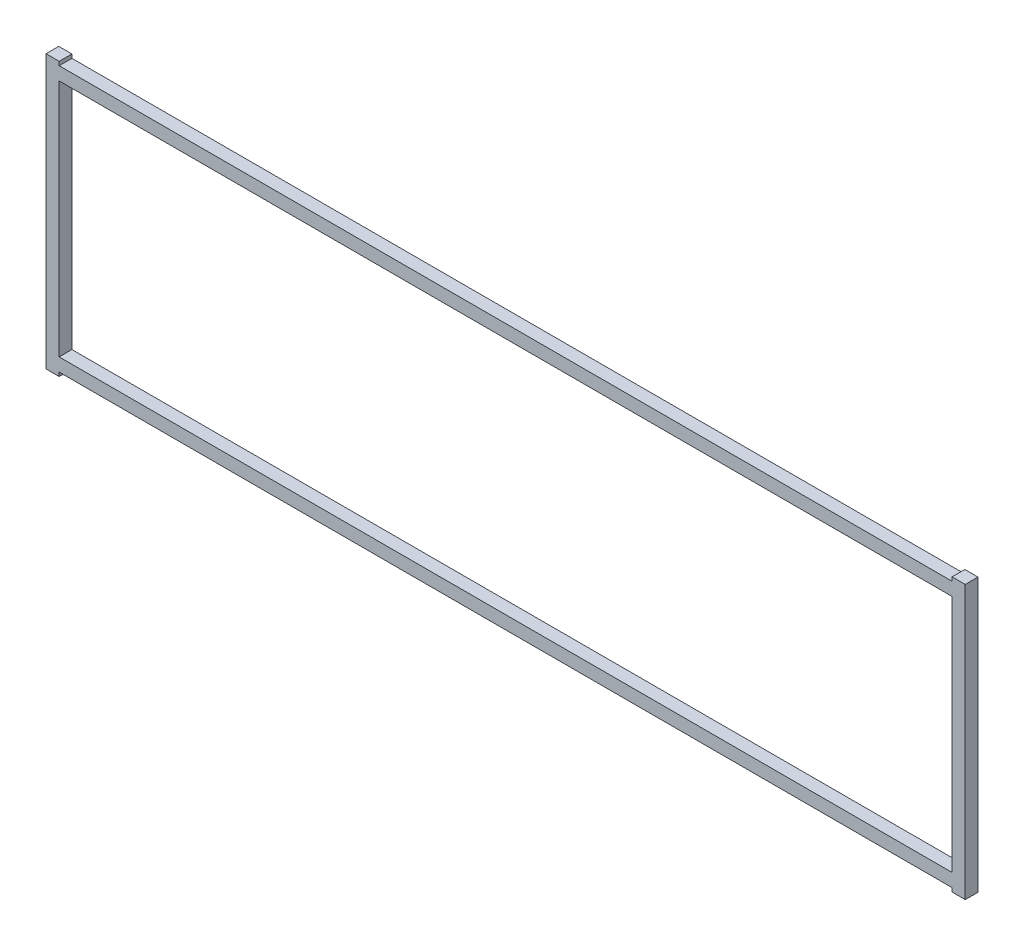
ISO-10303-21;
HEADER;
FILE_DESCRIPTION(('STEP AP214'),'2;1');
FILE_NAME('part.step','',(''),(''),'','','');
FILE_SCHEMA(('AUTOMOTIVE_DESIGN { 1 0 10303 214 1 1 1 1 }'));
ENDSEC;
DATA;
#1=APPLICATION_CONTEXT('core data for automotive mechanical design processes');
#2=APPLICATION_PROTOCOL_DEFINITION('international standard','automotive_design',2000,#1);
#3=PRODUCT_CONTEXT('',#1,'mechanical');
#4=PRODUCT('Part','Part','',(#3));
#5=PRODUCT_RELATED_PRODUCT_CATEGORY('part','',(#4));
#6=PRODUCT_DEFINITION_FORMATION('','',#4);
#7=PRODUCT_DEFINITION_CONTEXT('part definition',#1,'design');
#8=PRODUCT_DEFINITION('design','',#6,#7);
#9=PRODUCT_DEFINITION_SHAPE('','',#8);
#10=(LENGTH_UNIT() NAMED_UNIT(*) SI_UNIT(.MILLI.,.METRE.));
#11=(NAMED_UNIT(*) PLANE_ANGLE_UNIT() SI_UNIT($,.RADIAN.));
#12=(NAMED_UNIT(*) SI_UNIT($,.STERADIAN.) SOLID_ANGLE_UNIT());
#13=UNCERTAINTY_MEASURE_WITH_UNIT(LENGTH_MEASURE(1.E-05),#10,'distance_accuracy_value','');
#14=(GEOMETRIC_REPRESENTATION_CONTEXT(3) GLOBAL_UNCERTAINTY_ASSIGNED_CONTEXT((#13)) GLOBAL_UNIT_ASSIGNED_CONTEXT((#10,
#11,#12)) REPRESENTATION_CONTEXT('',''));
#15=CARTESIAN_POINT('',(0.,0.,0.));
#16=DIRECTION('',(0.,0.,1.));
#17=DIRECTION('',(1.,0.,0.));
#18=AXIS2_PLACEMENT_3D('',#15,#16,#17);
#19=CARTESIAN_POINT('',(0.,0.,6.35));
#20=DIRECTION('',(0.,0.,1.));
#21=DIRECTION('',(1.,0.,0.));
#22=AXIS2_PLACEMENT_3D('',#19,#20,#21);
#23=PLANE('',#22);
#24=DIRECTION('',(0.,-1.,0.));
#25=VECTOR('',#24,1.);
#26=CARTESIAN_POINT('',(222.1484,-66.0146,6.35));
#27=LINE('',#26,#25);
#28=CARTESIAN_POINT('',(222.1484,-66.0146,6.35));
#29=VERTEX_POINT('',#28);
#30=CARTESIAN_POINT('',(222.1484,-67.922775,6.35));
#31=VERTEX_POINT('',#30);
#32=EDGE_CURVE('E201',#29,#31,#27,.T.);
#33=ORIENTED_EDGE('',*,*,#32,.T.);
#34=DIRECTION('',(1.,0.,0.));
#35=VECTOR('',#34,1.);
#36=CARTESIAN_POINT('',(222.1484,-67.922775,6.35));
#37=LINE('',#36,#35);
#38=CARTESIAN_POINT('',(228.7016,-67.922775,6.35));
#39=VERTEX_POINT('',#38);
#40=EDGE_CURVE('E205',#31,#39,#37,.T.);
#41=ORIENTED_EDGE('',*,*,#40,.T.);
#42=DIRECTION('',(0.,1.,0.));
#43=VECTOR('',#42,1.);
#44=CARTESIAN_POINT('',(228.7016,-67.922775,6.35));
#45=LINE('',#44,#43);
#46=CARTESIAN_POINT('',(228.7016,67.922775,6.35));
#47=VERTEX_POINT('',#46);
#48=EDGE_CURVE('E209',#39,#47,#45,.T.);
#49=ORIENTED_EDGE('',*,*,#48,.T.);
#50=DIRECTION('',(-1.,0.,0.));
#51=VECTOR('',#50,1.);
#52=CARTESIAN_POINT('',(228.7016,67.922775,6.35));
#53=LINE('',#52,#51);
#54=CARTESIAN_POINT('',(222.1484,67.922775,6.35));
#55=VERTEX_POINT('',#54);
#56=EDGE_CURVE('E212',#47,#55,#53,.T.);
#57=ORIENTED_EDGE('',*,*,#56,.T.);
#58=DIRECTION('',(0.,-1.,0.));
#59=VECTOR('',#58,1.);
#60=CARTESIAN_POINT('',(222.1484,67.922775,6.35));
#61=LINE('',#60,#59);
#62=CARTESIAN_POINT('',(222.1484,66.0146,6.35));
#63=VERTEX_POINT('',#62);
#64=EDGE_CURVE('E215',#55,#63,#61,.T.);
#65=ORIENTED_EDGE('',*,*,#64,.T.);
#66=DIRECTION('',(-1.,0.,0.));
#67=VECTOR('',#66,1.);
#68=CARTESIAN_POINT('',(222.1484,66.0146,6.35));
#69=LINE('',#68,#67);
#70=CARTESIAN_POINT('',(-222.1484,66.0146,6.35));
#71=VERTEX_POINT('',#70);
#72=EDGE_CURVE('E218',#63,#71,#69,.T.);
#73=ORIENTED_EDGE('',*,*,#72,.T.);
#74=DIRECTION('',(0.,1.,0.));
#75=VECTOR('',#74,1.);
#76=CARTESIAN_POINT('',(-222.1484,66.0146,6.35));
#77=LINE('',#76,#75);
#78=CARTESIAN_POINT('',(-222.1484,67.922775,6.35));
#79=VERTEX_POINT('',#78);
#80=EDGE_CURVE('E221',#71,#79,#77,.T.);
#81=ORIENTED_EDGE('',*,*,#80,.T.);
#82=DIRECTION('',(-1.,0.,0.));
#83=VECTOR('',#82,1.);
#84=CARTESIAN_POINT('',(-222.1484,67.922775,6.35));
#85=LINE('',#84,#83);
#86=CARTESIAN_POINT('',(-228.7016,67.922775,6.35));
#87=VERTEX_POINT('',#86);
#88=EDGE_CURVE('E224',#79,#87,#85,.T.);
#89=ORIENTED_EDGE('',*,*,#88,.T.);
#90=DIRECTION('',(0.,-1.,0.));
#91=VECTOR('',#90,1.);
#92=CARTESIAN_POINT('',(-228.7016,67.922775,6.35));
#93=LINE('',#92,#91);
#94=CARTESIAN_POINT('',(-228.7016,-67.922775,6.35));
#95=VERTEX_POINT('',#94);
#96=EDGE_CURVE('E227',#87,#95,#93,.T.);
#97=ORIENTED_EDGE('',*,*,#96,.T.);
#98=DIRECTION('',(1.,0.,0.));
#99=VECTOR('',#98,1.);
#100=CARTESIAN_POINT('',(-228.7016,-67.922775,6.35));
#101=LINE('',#100,#99);
#102=CARTESIAN_POINT('',(-222.1484,-67.922775,6.35));
#103=VERTEX_POINT('',#102);
#104=EDGE_CURVE('E230',#95,#103,#101,.T.);
#105=ORIENTED_EDGE('',*,*,#104,.T.);
#106=DIRECTION('',(0.,1.,0.));
#107=VECTOR('',#106,1.);
#108=CARTESIAN_POINT('',(-222.1484,-67.922775,6.35));
#109=LINE('',#108,#107);
#110=CARTESIAN_POINT('',(-222.1484,-66.0146,6.35));
#111=VERTEX_POINT('',#110);
#112=EDGE_CURVE('E233',#103,#111,#109,.T.);
#113=ORIENTED_EDGE('',*,*,#112,.T.);
#114=DIRECTION('',(1.,0.,0.));
#115=VECTOR('',#114,1.);
#116=CARTESIAN_POINT('',(-222.1484,-66.0146,6.35));
#117=LINE('',#116,#115);
#118=EDGE_CURVE('E236',#111,#29,#117,.T.);
#119=ORIENTED_EDGE('',*,*,#118,.T.);
#120=EDGE_LOOP('',(#33,#41,#49,#57,#65,#73,#81,#89,#97,#105,#113,#119));
#121=FACE_BOUND('',#120,.T.);
#122=DIRECTION('',(0.,1.,0.));
#123=VECTOR('',#122,1.);
#124=CARTESIAN_POINT('',(222.1484,-59.4614,6.35));
#125=LINE('',#124,#123);
#126=CARTESIAN_POINT('',(222.1484,-59.4614,6.35));
#127=VERTEX_POINT('',#126);
#128=CARTESIAN_POINT('',(222.1484,59.4614,6.35));
#129=VERTEX_POINT('',#128);
#130=EDGE_CURVE('E162',#127,#129,#125,.T.);
#131=ORIENTED_EDGE('',*,*,#130,.F.);
#132=DIRECTION('',(1.,0.,0.));
#133=VECTOR('',#132,1.);
#134=CARTESIAN_POINT('',(-222.1484,-59.4614,6.35));
#135=LINE('',#134,#133);
#136=CARTESIAN_POINT('',(-222.1484,-59.4614,6.35));
#137=VERTEX_POINT('',#136);
#138=EDGE_CURVE('E153',#137,#127,#135,.T.);
#139=ORIENTED_EDGE('',*,*,#138,.F.);
#140=DIRECTION('',(0.,-1.,0.));
#141=VECTOR('',#140,1.);
#142=CARTESIAN_POINT('',(-222.1484,59.4614,6.35));
#143=LINE('',#142,#141);
#144=CARTESIAN_POINT('',(-222.1484,59.4614,6.35));
#145=VERTEX_POINT('',#144);
#146=EDGE_CURVE('E179',#145,#137,#143,.T.);
#147=ORIENTED_EDGE('',*,*,#146,.F.);
#148=DIRECTION('',(-1.,0.,0.));
#149=VECTOR('',#148,1.);
#150=CARTESIAN_POINT('',(222.1484,59.4614,6.35));
#151=LINE('',#150,#149);
#152=EDGE_CURVE('E175',#129,#145,#151,.T.);
#153=ORIENTED_EDGE('',*,*,#152,.F.);
#154=EDGE_LOOP('',(#131,#139,#147,#153));
#155=FACE_BOUND('',#154,.T.);
#156=ADVANCED_FACE('F39',(#121,#155),#23,.T.);
#157=CARTESIAN_POINT('',(0.,0.,0.));
#158=DIRECTION('',(0.,0.,1.));
#159=DIRECTION('',(1.,0.,0.));
#160=AXIS2_PLACEMENT_3D('',#157,#158,#159);
#161=PLANE('',#160);
#162=DIRECTION('',(0.,-1.,0.));
#163=VECTOR('',#162,1.);
#164=CARTESIAN_POINT('',(222.1484,-66.0146,0.));
#165=LINE('',#164,#163);
#166=CARTESIAN_POINT('',(222.1484,-66.0146,0.));
#167=VERTEX_POINT('',#166);
#168=CARTESIAN_POINT('',(222.1484,-67.922775,0.));
#169=VERTEX_POINT('',#168);
#170=EDGE_CURVE('E171',#167,#169,#165,.T.);
#171=ORIENTED_EDGE('',*,*,#170,.F.);
#172=DIRECTION('',(1.,0.,0.));
#173=VECTOR('',#172,1.);
#174=CARTESIAN_POINT('',(-222.1484,-66.0146,0.));
#175=LINE('',#174,#173);
#176=CARTESIAN_POINT('',(-222.1484,-66.0146,0.));
#177=VERTEX_POINT('',#176);
#178=EDGE_CURVE('E206',#177,#167,#175,.T.);
#179=ORIENTED_EDGE('',*,*,#178,.F.);
#180=DIRECTION('',(0.,1.,0.));
#181=VECTOR('',#180,1.);
#182=CARTESIAN_POINT('',(-222.1484,-67.922775,0.));
#183=LINE('',#182,#181);
#184=CARTESIAN_POINT('',(-222.1484,-67.922775,0.));
#185=VERTEX_POINT('',#184);
#186=EDGE_CURVE('E270',#185,#177,#183,.T.);
#187=ORIENTED_EDGE('',*,*,#186,.F.);
#188=DIRECTION('',(1.,0.,0.));
#189=VECTOR('',#188,1.);
#190=CARTESIAN_POINT('',(-228.7016,-67.922775,0.));
#191=LINE('',#190,#189);
#192=CARTESIAN_POINT('',(-228.7016,-67.922775,0.));
#193=VERTEX_POINT('',#192);
#194=EDGE_CURVE('E267',#193,#185,#191,.T.);
#195=ORIENTED_EDGE('',*,*,#194,.F.);
#196=DIRECTION('',(0.,-1.,0.));
#197=VECTOR('',#196,1.);
#198=CARTESIAN_POINT('',(-228.7016,67.922775,0.));
#199=LINE('',#198,#197);
#200=CARTESIAN_POINT('',(-228.7016,67.922775,0.));
#201=VERTEX_POINT('',#200);
#202=EDGE_CURVE('E264',#201,#193,#199,.T.);
#203=ORIENTED_EDGE('',*,*,#202,.F.);
#204=DIRECTION('',(-1.,0.,0.));
#205=VECTOR('',#204,1.);
#206=CARTESIAN_POINT('',(-222.1484,67.922775,0.));
#207=LINE('',#206,#205);
#208=CARTESIAN_POINT('',(-222.1484,67.922775,0.));
#209=VERTEX_POINT('',#208);
#210=EDGE_CURVE('E261',#209,#201,#207,.T.);
#211=ORIENTED_EDGE('',*,*,#210,.F.);
#212=DIRECTION('',(0.,1.,0.));
#213=VECTOR('',#212,1.);
#214=CARTESIAN_POINT('',(-222.1484,66.0146,0.));
#215=LINE('',#214,#213);
#216=CARTESIAN_POINT('',(-222.1484,66.0146,0.));
#217=VERTEX_POINT('',#216);
#218=EDGE_CURVE('E258',#217,#209,#215,.T.);
#219=ORIENTED_EDGE('',*,*,#218,.F.);
#220=DIRECTION('',(-1.,0.,0.));
#221=VECTOR('',#220,1.);
#222=CARTESIAN_POINT('',(222.1484,66.0146,0.));
#223=LINE('',#222,#221);
#224=CARTESIAN_POINT('',(222.1484,66.0146,0.));
#225=VERTEX_POINT('',#224);
#226=EDGE_CURVE('E255',#225,#217,#223,.T.);
#227=ORIENTED_EDGE('',*,*,#226,.F.);
#228=DIRECTION('',(0.,-1.,0.));
#229=VECTOR('',#228,1.);
#230=CARTESIAN_POINT('',(222.1484,67.922775,0.));
#231=LINE('',#230,#229);
#232=CARTESIAN_POINT('',(222.1484,67.922775,0.));
#233=VERTEX_POINT('',#232);
#234=EDGE_CURVE('E252',#233,#225,#231,.T.);
#235=ORIENTED_EDGE('',*,*,#234,.F.);
#236=DIRECTION('',(-1.,0.,0.));
#237=VECTOR('',#236,1.);
#238=CARTESIAN_POINT('',(228.7016,67.922775,0.));
#239=LINE('',#238,#237);
#240=CARTESIAN_POINT('',(228.7016,67.922775,0.));
#241=VERTEX_POINT('',#240);
#242=EDGE_CURVE('E249',#241,#233,#239,.T.);
#243=ORIENTED_EDGE('',*,*,#242,.F.);
#244=DIRECTION('',(0.,1.,0.));
#245=VECTOR('',#244,1.);
#246=CARTESIAN_POINT('',(228.7016,-67.922775,0.));
#247=LINE('',#246,#245);
#248=CARTESIAN_POINT('',(228.7016,-67.922775,0.));
#249=VERTEX_POINT('',#248);
#250=EDGE_CURVE('E246',#249,#241,#247,.T.);
#251=ORIENTED_EDGE('',*,*,#250,.F.);
#252=DIRECTION('',(1.,0.,0.));
#253=VECTOR('',#252,1.);
#254=CARTESIAN_POINT('',(222.1484,-67.922775,0.));
#255=LINE('',#254,#253);
#256=EDGE_CURVE('E243',#169,#249,#255,.T.);
#257=ORIENTED_EDGE('',*,*,#256,.F.);
#258=EDGE_LOOP('',(#171,#179,#187,#195,#203,#211,#219,#227,#235,#243,#251,#257));
#259=FACE_BOUND('',#258,.T.);
#260=DIRECTION('',(1.,0.,0.));
#261=VECTOR('',#260,1.);
#262=CARTESIAN_POINT('',(-222.1484,-59.4614,0.));
#263=LINE('',#262,#261);
#264=CARTESIAN_POINT('',(-222.1484,-59.4614,0.));
#265=VERTEX_POINT('',#264);
#266=CARTESIAN_POINT('',(222.1484,-59.4614,0.));
#267=VERTEX_POINT('',#266);
#268=EDGE_CURVE('E63',#265,#267,#263,.T.);
#269=ORIENTED_EDGE('',*,*,#268,.T.);
#270=DIRECTION('',(0.,1.,0.));
#271=VECTOR('',#270,1.);
#272=CARTESIAN_POINT('',(222.1484,-59.4614,0.));
#273=LINE('',#272,#271);
#274=CARTESIAN_POINT('',(222.1484,59.4614,0.));
#275=VERTEX_POINT('',#274);
#276=EDGE_CURVE('E169',#267,#275,#273,.T.);
#277=ORIENTED_EDGE('',*,*,#276,.T.);
#278=DIRECTION('',(-1.,0.,0.));
#279=VECTOR('',#278,1.);
#280=CARTESIAN_POINT('',(222.1484,59.4614,0.));
#281=LINE('',#280,#279);
#282=CARTESIAN_POINT('',(-222.1484,59.4614,0.));
#283=VERTEX_POINT('',#282);
#284=EDGE_CURVE('E188',#275,#283,#281,.T.);
#285=ORIENTED_EDGE('',*,*,#284,.T.);
#286=DIRECTION('',(0.,-1.,0.));
#287=VECTOR('',#286,1.);
#288=CARTESIAN_POINT('',(-222.1484,59.4614,0.));
#289=LINE('',#288,#287);
#290=EDGE_CURVE('E163',#283,#265,#289,.T.);
#291=ORIENTED_EDGE('',*,*,#290,.T.);
#292=EDGE_LOOP('',(#269,#277,#285,#291));
#293=FACE_BOUND('',#292,.T.);
#294=ADVANCED_FACE('F325',(#259,#293),#161,.F.);
#295=CARTESIAN_POINT('',(222.1484,-66.0146,6.35));
#296=DIRECTION('',(1.,0.,0.));
#297=DIRECTION('',(0.,0.,-1.));
#298=AXIS2_PLACEMENT_3D('',#295,#296,#297);
#299=PLANE('',#298);
#300=ORIENTED_EDGE('',*,*,#170,.T.);
#301=DIRECTION('',(0.,0.,-1.));
#302=VECTOR('',#301,1.);
#303=CARTESIAN_POINT('',(222.1484,-67.922775,6.35));
#304=LINE('',#303,#302);
#305=EDGE_CURVE('E11',#31,#169,#304,.T.);
#306=ORIENTED_EDGE('',*,*,#305,.F.);
#307=ORIENTED_EDGE('',*,*,#32,.F.);
#308=DIRECTION('',(0.,0.,-1.));
#309=VECTOR('',#308,1.);
#310=CARTESIAN_POINT('',(222.1484,-66.0146,6.35));
#311=LINE('',#310,#309);
#312=EDGE_CURVE('E239',#29,#167,#311,.T.);
#313=ORIENTED_EDGE('',*,*,#312,.T.);
#314=EDGE_LOOP('',(#300,#306,#307,#313));
#315=FACE_BOUND('',#314,.T.);
#316=ADVANCED_FACE('F41',(#315),#299,.F.);
#317=CARTESIAN_POINT('',(222.1484,-67.922775,6.35));
#318=DIRECTION('',(0.,1.,0.));
#319=DIRECTION('',(0.,0.,1.));
#320=AXIS2_PLACEMENT_3D('',#317,#318,#319);
#321=PLANE('',#320);
#322=ORIENTED_EDGE('',*,*,#256,.T.);
#323=DIRECTION('',(0.,0.,-1.));
#324=VECTOR('',#323,1.);
#325=CARTESIAN_POINT('',(228.7016,-67.922775,6.35));
#326=LINE('',#325,#324);
#327=EDGE_CURVE('E48',#39,#249,#326,.T.);
#328=ORIENTED_EDGE('',*,*,#327,.F.);
#329=ORIENTED_EDGE('',*,*,#40,.F.);
#330=ORIENTED_EDGE('',*,*,#305,.T.);
#331=EDGE_LOOP('',(#322,#328,#329,#330));
#332=FACE_BOUND('',#331,.T.);
#333=ADVANCED_FACE('F342',(#332),#321,.F.);
#334=CARTESIAN_POINT('',(228.7016,-67.922775,6.35));
#335=DIRECTION('',(-1.,0.,0.));
#336=DIRECTION('',(0.,0.,1.));
#337=AXIS2_PLACEMENT_3D('',#334,#335,#336);
#338=PLANE('',#337);
#339=ORIENTED_EDGE('',*,*,#250,.T.);
#340=DIRECTION('',(0.,0.,-1.));
#341=VECTOR('',#340,1.);
#342=CARTESIAN_POINT('',(228.7016,67.922775,6.35));
#343=LINE('',#342,#341);
#344=EDGE_CURVE('E310',#47,#241,#343,.T.);
#345=ORIENTED_EDGE('',*,*,#344,.F.);
#346=ORIENTED_EDGE('',*,*,#48,.F.);
#347=ORIENTED_EDGE('',*,*,#327,.T.);
#348=EDGE_LOOP('',(#339,#345,#346,#347));
#349=FACE_BOUND('',#348,.T.);
#350=ADVANCED_FACE('F319',(#349),#338,.F.);
#351=CARTESIAN_POINT('',(228.7016,67.922775,6.35));
#352=DIRECTION('',(0.,-1.,0.));
#353=DIRECTION('',(0.,0.,-1.));
#354=AXIS2_PLACEMENT_3D('',#351,#352,#353);
#355=PLANE('',#354);
#356=ORIENTED_EDGE('',*,*,#242,.T.);
#357=DIRECTION('',(0.,0.,-1.));
#358=VECTOR('',#357,1.);
#359=CARTESIAN_POINT('',(222.1484,67.922775,6.35));
#360=LINE('',#359,#358);
#361=EDGE_CURVE('E306',#55,#233,#360,.T.);
#362=ORIENTED_EDGE('',*,*,#361,.F.);
#363=ORIENTED_EDGE('',*,*,#56,.F.);
#364=ORIENTED_EDGE('',*,*,#344,.T.);
#365=EDGE_LOOP('',(#356,#362,#363,#364));
#366=FACE_BOUND('',#365,.T.);
#367=ADVANCED_FACE('F331',(#366),#355,.F.);
#368=CARTESIAN_POINT('',(222.1484,67.922775,6.35));
#369=DIRECTION('',(1.,0.,0.));
#370=DIRECTION('',(0.,1.,0.));
#371=AXIS2_PLACEMENT_3D('',#368,#369,#370);
#372=PLANE('',#371);
#373=ORIENTED_EDGE('',*,*,#234,.T.);
#374=DIRECTION('',(0.,0.,-1.));
#375=VECTOR('',#374,1.);
#376=CARTESIAN_POINT('',(222.1484,66.0146,6.35));
#377=LINE('',#376,#375);
#378=EDGE_CURVE('E302',#63,#225,#377,.T.);
#379=ORIENTED_EDGE('',*,*,#378,.F.);
#380=ORIENTED_EDGE('',*,*,#64,.F.);
#381=ORIENTED_EDGE('',*,*,#361,.T.);
#382=EDGE_LOOP('',(#373,#379,#380,#381));
#383=FACE_BOUND('',#382,.T.);
#384=ADVANCED_FACE('F335',(#383),#372,.F.);
#385=CARTESIAN_POINT('',(222.1484,66.0146,6.35));
#386=DIRECTION('',(0.,-1.,0.));
#387=DIRECTION('',(0.,0.,-1.));
#388=AXIS2_PLACEMENT_3D('',#385,#386,#387);
#389=PLANE('',#388);
#390=ORIENTED_EDGE('',*,*,#226,.T.);
#391=DIRECTION('',(0.,0.,-1.));
#392=VECTOR('',#391,1.);
#393=CARTESIAN_POINT('',(-222.1484,66.0146,6.35));
#394=LINE('',#393,#392);
#395=EDGE_CURVE('E298',#71,#217,#394,.T.);
#396=ORIENTED_EDGE('',*,*,#395,.F.);
#397=ORIENTED_EDGE('',*,*,#72,.F.);
#398=ORIENTED_EDGE('',*,*,#378,.T.);
#399=EDGE_LOOP('',(#390,#396,#397,#398));
#400=FACE_BOUND('',#399,.T.);
#401=ADVANCED_FACE('F375',(#400),#389,.F.);
#402=CARTESIAN_POINT('',(-222.1484,66.0146,6.35));
#403=DIRECTION('',(-1.,0.,0.));
#404=DIRECTION('',(0.,0.,1.));
#405=AXIS2_PLACEMENT_3D('',#402,#403,#404);
#406=PLANE('',#405);
#407=ORIENTED_EDGE('',*,*,#218,.T.);
#408=DIRECTION('',(0.,0.,-1.));
#409=VECTOR('',#408,1.);
#410=CARTESIAN_POINT('',(-222.1484,67.922775,6.35));
#411=LINE('',#410,#409);
#412=EDGE_CURVE('E294',#79,#209,#411,.T.);
#413=ORIENTED_EDGE('',*,*,#412,.F.);
#414=ORIENTED_EDGE('',*,*,#80,.F.);
#415=ORIENTED_EDGE('',*,*,#395,.T.);
#416=EDGE_LOOP('',(#407,#413,#414,#415));
#417=FACE_BOUND('',#416,.T.);
#418=ADVANCED_FACE('F373',(#417),#406,.F.);
#419=CARTESIAN_POINT('',(-222.1484,67.922775,6.35));
#420=DIRECTION('',(0.,-1.,0.));
#421=DIRECTION('',(0.,0.,-1.));
#422=AXIS2_PLACEMENT_3D('',#419,#420,#421);
#423=PLANE('',#422);
#424=ORIENTED_EDGE('',*,*,#210,.T.);
#425=DIRECTION('',(0.,0.,-1.));
#426=VECTOR('',#425,1.);
#427=CARTESIAN_POINT('',(-228.7016,67.922775,6.35));
#428=LINE('',#427,#426);
#429=EDGE_CURVE('E290',#87,#201,#428,.T.);
#430=ORIENTED_EDGE('',*,*,#429,.F.);
#431=ORIENTED_EDGE('',*,*,#88,.F.);
#432=ORIENTED_EDGE('',*,*,#412,.T.);
#433=EDGE_LOOP('',(#424,#430,#431,#432));
#434=FACE_BOUND('',#433,.T.);
#435=ADVANCED_FACE('F369',(#434),#423,.F.);
#436=CARTESIAN_POINT('',(-228.7016,67.922775,6.35));
#437=DIRECTION('',(1.,0.,0.));
#438=DIRECTION('',(0.,0.,-1.));
#439=AXIS2_PLACEMENT_3D('',#436,#437,#438);
#440=PLANE('',#439);
#441=ORIENTED_EDGE('',*,*,#202,.T.);
#442=DIRECTION('',(0.,0.,-1.));
#443=VECTOR('',#442,1.);
#444=CARTESIAN_POINT('',(-228.7016,-67.922775,6.35));
#445=LINE('',#444,#443);
#446=EDGE_CURVE('E286',#95,#193,#445,.T.);
#447=ORIENTED_EDGE('',*,*,#446,.F.);
#448=ORIENTED_EDGE('',*,*,#96,.F.);
#449=ORIENTED_EDGE('',*,*,#429,.T.);
#450=EDGE_LOOP('',(#441,#447,#448,#449));
#451=FACE_BOUND('',#450,.T.);
#452=ADVANCED_FACE('F364',(#451),#440,.F.);
#453=CARTESIAN_POINT('',(-228.7016,-67.922775,6.35));
#454=DIRECTION('',(0.,1.,0.));
#455=DIRECTION('',(0.,0.,1.));
#456=AXIS2_PLACEMENT_3D('',#453,#454,#455);
#457=PLANE('',#456);
#458=ORIENTED_EDGE('',*,*,#194,.T.);
#459=DIRECTION('',(0.,0.,-1.));
#460=VECTOR('',#459,1.);
#461=CARTESIAN_POINT('',(-222.1484,-67.922775,6.35));
#462=LINE('',#461,#460);
#463=EDGE_CURVE('E282',#103,#185,#462,.T.);
#464=ORIENTED_EDGE('',*,*,#463,.F.);
#465=ORIENTED_EDGE('',*,*,#104,.F.);
#466=ORIENTED_EDGE('',*,*,#446,.T.);
#467=EDGE_LOOP('',(#458,#464,#465,#466));
#468=FACE_BOUND('',#467,.T.);
#469=ADVANCED_FACE('F358',(#468),#457,.F.);
#470=CARTESIAN_POINT('',(-222.1484,-67.922775,6.35));
#471=DIRECTION('',(-1.,0.,0.));
#472=DIRECTION('',(0.,-1.,0.));
#473=AXIS2_PLACEMENT_3D('',#470,#471,#472);
#474=PLANE('',#473);
#475=ORIENTED_EDGE('',*,*,#186,.T.);
#476=DIRECTION('',(0.,0.,-1.));
#477=VECTOR('',#476,1.);
#478=CARTESIAN_POINT('',(-222.1484,-66.0146,6.35));
#479=LINE('',#478,#477);
#480=EDGE_CURVE('E278',#111,#177,#479,.T.);
#481=ORIENTED_EDGE('',*,*,#480,.F.);
#482=ORIENTED_EDGE('',*,*,#112,.F.);
#483=ORIENTED_EDGE('',*,*,#463,.T.);
#484=EDGE_LOOP('',(#475,#481,#482,#483));
#485=FACE_BOUND('',#484,.T.);
#486=ADVANCED_FACE('F354',(#485),#474,.F.);
#487=CARTESIAN_POINT('',(-222.1484,-66.0146,6.35));
#488=DIRECTION('',(0.,1.,0.));
#489=DIRECTION('',(0.,0.,1.));
#490=AXIS2_PLACEMENT_3D('',#487,#488,#489);
#491=PLANE('',#490);
#492=ORIENTED_EDGE('',*,*,#178,.T.);
#493=ORIENTED_EDGE('',*,*,#312,.F.);
#494=ORIENTED_EDGE('',*,*,#118,.F.);
#495=ORIENTED_EDGE('',*,*,#480,.T.);
#496=EDGE_LOOP('',(#492,#493,#494,#495));
#497=FACE_BOUND('',#496,.T.);
#498=ADVANCED_FACE('F349',(#497),#491,.F.);
#499=CARTESIAN_POINT('',(-222.1484,-59.4614,6.35));
#500=DIRECTION('',(0.,1.,0.));
#501=DIRECTION('',(0.,0.,1.));
#502=AXIS2_PLACEMENT_3D('',#499,#500,#501);
#503=PLANE('',#502);
#504=ORIENTED_EDGE('',*,*,#268,.F.);
#505=DIRECTION('',(0.,0.,-1.));
#506=VECTOR('',#505,1.);
#507=CARTESIAN_POINT('',(-222.1484,-59.4614,6.35));
#508=LINE('',#507,#506);
#509=EDGE_CURVE('E157',#137,#265,#508,.T.);
#510=ORIENTED_EDGE('',*,*,#509,.F.);
#511=ORIENTED_EDGE('',*,*,#138,.T.);
#512=DIRECTION('',(0.,0.,-1.));
#513=VECTOR('',#512,1.);
#514=CARTESIAN_POINT('',(222.1484,-59.4614,6.35));
#515=LINE('',#514,#513);
#516=EDGE_CURVE('E156',#127,#267,#515,.T.);
#517=ORIENTED_EDGE('',*,*,#516,.T.);
#518=EDGE_LOOP('',(#504,#510,#511,#517));
#519=FACE_BOUND('',#518,.T.);
#520=ADVANCED_FACE('F155',(#519),#503,.T.);
#521=CARTESIAN_POINT('',(222.1484,-59.4614,6.35));
#522=DIRECTION('',(-1.,0.,0.));
#523=DIRECTION('',(0.,0.,1.));
#524=AXIS2_PLACEMENT_3D('',#521,#522,#523);
#525=PLANE('',#524);
#526=ORIENTED_EDGE('',*,*,#276,.F.);
#527=ORIENTED_EDGE('',*,*,#516,.F.);
#528=ORIENTED_EDGE('',*,*,#130,.T.);
#529=DIRECTION('',(0.,0.,-1.));
#530=VECTOR('',#529,1.);
#531=CARTESIAN_POINT('',(222.1484,59.4614,6.35));
#532=LINE('',#531,#530);
#533=EDGE_CURVE('E172',#129,#275,#532,.T.);
#534=ORIENTED_EDGE('',*,*,#533,.T.);
#535=EDGE_LOOP('',(#526,#527,#528,#534));
#536=FACE_BOUND('',#535,.T.);
#537=ADVANCED_FACE('F166',(#536),#525,.T.);
#538=CARTESIAN_POINT('',(222.1484,59.4614,6.35));
#539=DIRECTION('',(0.,-1.,0.));
#540=DIRECTION('',(0.,0.,-1.));
#541=AXIS2_PLACEMENT_3D('',#538,#539,#540);
#542=PLANE('',#541);
#543=ORIENTED_EDGE('',*,*,#284,.F.);
#544=ORIENTED_EDGE('',*,*,#533,.F.);
#545=ORIENTED_EDGE('',*,*,#152,.T.);
#546=DIRECTION('',(0.,0.,-1.));
#547=VECTOR('',#546,1.);
#548=CARTESIAN_POINT('',(-222.1484,59.4614,6.35));
#549=LINE('',#548,#547);
#550=EDGE_CURVE('E55',#145,#283,#549,.T.);
#551=ORIENTED_EDGE('',*,*,#550,.T.);
#552=EDGE_LOOP('',(#543,#544,#545,#551));
#553=FACE_BOUND('',#552,.T.);
#554=ADVANCED_FACE('F433',(#553),#542,.T.);
#555=CARTESIAN_POINT('',(-222.1484,59.4614,6.35));
#556=DIRECTION('',(1.,0.,0.));
#557=DIRECTION('',(0.,0.,-1.));
#558=AXIS2_PLACEMENT_3D('',#555,#556,#557);
#559=PLANE('',#558);
#560=ORIENTED_EDGE('',*,*,#290,.F.);
#561=ORIENTED_EDGE('',*,*,#550,.F.);
#562=ORIENTED_EDGE('',*,*,#146,.T.);
#563=ORIENTED_EDGE('',*,*,#509,.T.);
#564=EDGE_LOOP('',(#560,#561,#562,#563));
#565=FACE_BOUND('',#564,.T.);
#566=ADVANCED_FACE('F439',(#565),#559,.T.);
#567=CLOSED_SHELL('',(#156,#294,#316,#333,#350,#367,#384,#401,#418,#435,#452,#469,#486,#498,
#520,#537,#554,#566));
#568=MANIFOLD_SOLID_BREP('B2',#567);
#569=ADVANCED_BREP_SHAPE_REPRESENTATION('',(#18,#568),#14);
#570=SHAPE_DEFINITION_REPRESENTATION(#9,#569);
ENDSEC;
END-ISO-10303-21;
